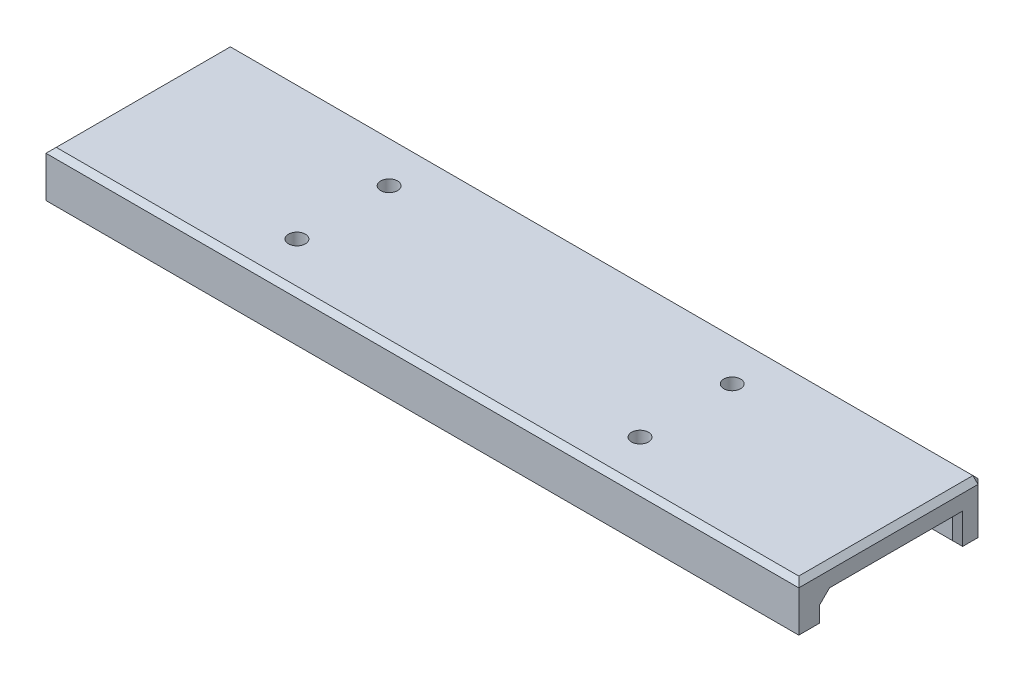
ISO-10303-21;
HEADER;
FILE_DESCRIPTION(('STEP AP214'),'2;1');
FILE_NAME('part.step','',(''),(''),'','','');
FILE_SCHEMA(('AUTOMOTIVE_DESIGN { 1 0 10303 214 1 1 1 1 }'));
ENDSEC;
DATA;
#1=APPLICATION_CONTEXT('core data for automotive mechanical design processes');
#2=APPLICATION_PROTOCOL_DEFINITION('international standard','automotive_design',2000,#1);
#3=PRODUCT_CONTEXT('',#1,'mechanical');
#4=PRODUCT('Part','Part','',(#3));
#5=PRODUCT_RELATED_PRODUCT_CATEGORY('part','',(#4));
#6=PRODUCT_DEFINITION_FORMATION('','',#4);
#7=PRODUCT_DEFINITION_CONTEXT('part definition',#1,'design');
#8=PRODUCT_DEFINITION('design','',#6,#7);
#9=PRODUCT_DEFINITION_SHAPE('','',#8);
#10=(LENGTH_UNIT() NAMED_UNIT(*) SI_UNIT(.MILLI.,.METRE.));
#11=(NAMED_UNIT(*) PLANE_ANGLE_UNIT() SI_UNIT($,.RADIAN.));
#12=(NAMED_UNIT(*) SI_UNIT($,.STERADIAN.) SOLID_ANGLE_UNIT());
#13=UNCERTAINTY_MEASURE_WITH_UNIT(LENGTH_MEASURE(1.E-05),#10,'distance_accuracy_value','');
#14=(GEOMETRIC_REPRESENTATION_CONTEXT(3) GLOBAL_UNCERTAINTY_ASSIGNED_CONTEXT((#13)) GLOBAL_UNIT_ASSIGNED_CONTEXT((#10,
#11,#12)) REPRESENTATION_CONTEXT('',''));
#15=CARTESIAN_POINT('',(0.,0.,0.));
#16=DIRECTION('',(0.,0.,1.));
#17=DIRECTION('',(1.,0.,0.));
#18=AXIS2_PLACEMENT_3D('',#15,#16,#17);
#19=CARTESIAN_POINT('',(-73.5,5.,18.));
#20=DIRECTION('',(1.,0.,0.));
#21=DIRECTION('',(0.,0.,-1.));
#22=AXIS2_PLACEMENT_3D('',#19,#20,#21);
#23=PLANE('',#22);
#24=DIRECTION('',(0.,0.,1.));
#25=VECTOR('',#24,1.);
#26=CARTESIAN_POINT('',(-73.5,-5.,18.));
#27=LINE('',#26,#25);
#28=CARTESIAN_POINT('',(-73.5,-5.,-17.));
#29=VERTEX_POINT('',#28);
#30=CARTESIAN_POINT('',(-73.5,-5.,-14.));
#31=VERTEX_POINT('',#30);
#32=EDGE_CURVE('E368',#29,#31,#27,.T.);
#33=ORIENTED_EDGE('',*,*,#32,.T.);
#34=DIRECTION('',(0.,1.,0.));
#35=VECTOR('',#34,1.);
#36=CARTESIAN_POINT('',(-73.5,5.,-14.));
#37=LINE('',#36,#35);
#38=CARTESIAN_POINT('',(-73.5,1.,-14.));
#39=VERTEX_POINT('',#38);
#40=EDGE_CURVE('E249',#31,#39,#37,.T.);
#41=ORIENTED_EDGE('',*,*,#40,.T.);
#42=DIRECTION('',(0.,0.,1.));
#43=VECTOR('',#42,1.);
#44=CARTESIAN_POINT('',(-73.5,1.,18.));
#45=LINE('',#44,#43);
#46=CARTESIAN_POINT('',(-73.5,1.,12.));
#47=VERTEX_POINT('',#46);
#48=EDGE_CURVE('E247',#39,#47,#45,.T.);
#49=ORIENTED_EDGE('',*,*,#48,.T.);
#50=DIRECTION('',(0.,0.707106781186543,-0.707106781186552));
#51=VECTOR('',#50,1.);
#52=CARTESIAN_POINT('',(-73.5,1.,12.));
#53=LINE('',#52,#51);
#54=CARTESIAN_POINT('',(-73.5,0.,13.));
#55=VERTEX_POINT('',#54);
#56=EDGE_CURVE('E244',#55,#47,#53,.T.);
#57=ORIENTED_EDGE('',*,*,#56,.F.);
#58=DIRECTION('',(0.,0.707106781186543,-0.707106781186552));
#59=VECTOR('',#58,1.);
#60=CARTESIAN_POINT('',(-73.5,1.,12.));
#61=LINE('',#60,#59);
#62=CARTESIAN_POINT('',(-73.5,-0.999999999999987,14.));
#63=VERTEX_POINT('',#62);
#64=EDGE_CURVE('E241',#63,#55,#61,.T.);
#65=ORIENTED_EDGE('',*,*,#64,.F.);
#66=DIRECTION('',(0.,-1.,0.));
#67=VECTOR('',#66,1.);
#68=CARTESIAN_POINT('',(-73.5,5.,14.));
#69=LINE('',#68,#67);
#70=CARTESIAN_POINT('',(-73.5,-4.00000000000001,14.));
#71=VERTEX_POINT('',#70);
#72=EDGE_CURVE('E239',#63,#71,#69,.T.);
#73=ORIENTED_EDGE('',*,*,#72,.T.);
#74=DIRECTION('',(0.,0.,1.));
#75=VECTOR('',#74,1.);
#76=CARTESIAN_POINT('',(-73.5,-4.00000000000001,18.));
#77=LINE('',#76,#75);
#78=CARTESIAN_POINT('',(-73.5,-4.00000000000001,18.));
#79=VERTEX_POINT('',#78);
#80=EDGE_CURVE('E237',#71,#79,#77,.T.);
#81=ORIENTED_EDGE('',*,*,#80,.T.);
#82=DIRECTION('',(0.,-1.,0.));
#83=VECTOR('',#82,1.);
#84=CARTESIAN_POINT('',(-73.5,5.,18.));
#85=LINE('',#84,#83);
#86=CARTESIAN_POINT('',(-73.5,3.99999999999999,18.));
#87=VERTEX_POINT('',#86);
#88=EDGE_CURVE('E374',#87,#79,#85,.T.);
#89=ORIENTED_EDGE('',*,*,#88,.F.);
#90=DIRECTION('',(0.,0.,-1.));
#91=VECTOR('',#90,1.);
#92=CARTESIAN_POINT('',(-73.5,3.99999999999999,18.));
#93=LINE('',#92,#91);
#94=CARTESIAN_POINT('',(-73.5,3.99999999999999,-17.));
#95=VERTEX_POINT('',#94);
#96=EDGE_CURVE('E235',#87,#95,#93,.T.);
#97=ORIENTED_EDGE('',*,*,#96,.T.);
#98=DIRECTION('',(0.,-1.,0.));
#99=VECTOR('',#98,1.);
#100=CARTESIAN_POINT('',(-73.5,5.,-17.));
#101=LINE('',#100,#99);
#102=EDGE_CURVE('E233',#95,#29,#101,.T.);
#103=ORIENTED_EDGE('',*,*,#102,.T.);
#104=EDGE_LOOP('',(#33,#41,#49,#57,#65,#73,#81,#89,#97,#103));
#105=FACE_BOUND('',#104,.T.);
#106=ADVANCED_FACE('F35',(#105),#23,.F.);
#107=CARTESIAN_POINT('',(73.5,5.,18.));
#108=DIRECTION('',(-1.,0.,0.));
#109=DIRECTION('',(0.,0.,1.));
#110=AXIS2_PLACEMENT_3D('',#107,#108,#109);
#111=PLANE('',#110);
#112=DIRECTION('',(0.,0.,-1.));
#113=VECTOR('',#112,1.);
#114=CARTESIAN_POINT('',(73.5,0.999999999999987,18.));
#115=LINE('',#114,#113);
#116=CARTESIAN_POINT('',(73.5,0.999999999999987,12.));
#117=VERTEX_POINT('',#116);
#118=CARTESIAN_POINT('',(73.5,0.999999999999987,-14.));
#119=VERTEX_POINT('',#118);
#120=EDGE_CURVE('E195',#117,#119,#115,.T.);
#121=ORIENTED_EDGE('',*,*,#120,.T.);
#122=DIRECTION('',(0.,-1.,0.));
#123=VECTOR('',#122,1.);
#124=CARTESIAN_POINT('',(73.5,5.,-14.));
#125=LINE('',#124,#123);
#126=CARTESIAN_POINT('',(73.5,-5.,-14.));
#127=VERTEX_POINT('',#126);
#128=EDGE_CURVE('E197',#119,#127,#125,.T.);
#129=ORIENTED_EDGE('',*,*,#128,.T.);
#130=DIRECTION('',(0.,0.,-1.));
#131=VECTOR('',#130,1.);
#132=CARTESIAN_POINT('',(73.5,-5.,18.));
#133=LINE('',#132,#131);
#134=CARTESIAN_POINT('',(73.5,-5.,-17.));
#135=VERTEX_POINT('',#134);
#136=EDGE_CURVE('E365',#127,#135,#133,.T.);
#137=ORIENTED_EDGE('',*,*,#136,.T.);
#138=DIRECTION('',(0.,1.,0.));
#139=VECTOR('',#138,1.);
#140=CARTESIAN_POINT('',(73.5,5.,-17.));
#141=LINE('',#140,#139);
#142=CARTESIAN_POINT('',(73.5,3.99999999999999,-17.));
#143=VERTEX_POINT('',#142);
#144=EDGE_CURVE('E386',#135,#143,#141,.T.);
#145=ORIENTED_EDGE('',*,*,#144,.T.);
#146=DIRECTION('',(0.,0.,1.));
#147=VECTOR('',#146,1.);
#148=CARTESIAN_POINT('',(73.5,3.99999999999999,18.));
#149=LINE('',#148,#147);
#150=CARTESIAN_POINT('',(73.5,3.99999999999999,18.));
#151=VERTEX_POINT('',#150);
#152=EDGE_CURVE('E388',#143,#151,#149,.T.);
#153=ORIENTED_EDGE('',*,*,#152,.T.);
#154=DIRECTION('',(0.,-1.,0.));
#155=VECTOR('',#154,1.);
#156=CARTESIAN_POINT('',(73.5,5.,18.));
#157=LINE('',#156,#155);
#158=CARTESIAN_POINT('',(73.5,-4.00000000000001,18.));
#159=VERTEX_POINT('',#158);
#160=EDGE_CURVE('E371',#151,#159,#157,.T.);
#161=ORIENTED_EDGE('',*,*,#160,.T.);
#162=DIRECTION('',(0.,0.,-1.));
#163=VECTOR('',#162,1.);
#164=CARTESIAN_POINT('',(73.5,-4.00000000000001,13.));
#165=LINE('',#164,#163);
#166=CARTESIAN_POINT('',(73.5,-4.00000000000001,14.));
#167=VERTEX_POINT('',#166);
#168=EDGE_CURVE('E390',#159,#167,#165,.T.);
#169=ORIENTED_EDGE('',*,*,#168,.T.);
#170=DIRECTION('',(0.,1.,0.));
#171=VECTOR('',#170,1.);
#172=CARTESIAN_POINT('',(73.5,5.,14.));
#173=LINE('',#172,#171);
#174=CARTESIAN_POINT('',(73.5,-0.999999999999987,14.));
#175=VERTEX_POINT('',#174);
#176=EDGE_CURVE('E187',#167,#175,#173,.T.);
#177=ORIENTED_EDGE('',*,*,#176,.T.);
#178=DIRECTION('',(0.,-0.707106781186543,0.707106781186552));
#179=VECTOR('',#178,1.);
#180=CARTESIAN_POINT('',(73.5,-0.999999999999987,14.));
#181=LINE('',#180,#179);
#182=CARTESIAN_POINT('',(73.5,0.,13.));
#183=VERTEX_POINT('',#182);
#184=EDGE_CURVE('E181',#183,#175,#181,.T.);
#185=ORIENTED_EDGE('',*,*,#184,.F.);
#186=DIRECTION('',(0.,-0.707106781186543,0.707106781186552));
#187=VECTOR('',#186,1.);
#188=CARTESIAN_POINT('',(73.5,-0.999999999999987,14.));
#189=LINE('',#188,#187);
#190=EDGE_CURVE('E184',#117,#183,#189,.T.);
#191=ORIENTED_EDGE('',*,*,#190,.F.);
#192=EDGE_LOOP('',(#121,#129,#137,#145,#153,#161,#169,#177,#185,#191));
#193=FACE_BOUND('',#192,.T.);
#194=ADVANCED_FACE('F183',(#193),#111,.F.);
#195=CARTESIAN_POINT('',(0.,-5.,0.));
#196=DIRECTION('',(0.,-1.,0.));
#197=DIRECTION('',(0.,0.,-1.));
#198=AXIS2_PLACEMENT_3D('',#195,#196,#197);
#199=PLANE('',#198);
#200=DIRECTION('',(0.,0.,1.));
#201=VECTOR('',#200,1.);
#202=CARTESIAN_POINT('',(72.5,-5.,18.));
#203=LINE('',#202,#201);
#204=CARTESIAN_POINT('',(72.5,-5.,14.));
#205=VERTEX_POINT('',#204);
#206=CARTESIAN_POINT('',(72.5,-5.,17.));
#207=VERTEX_POINT('',#206);
#208=EDGE_CURVE('E209',#205,#207,#203,.T.);
#209=ORIENTED_EDGE('',*,*,#208,.T.);
#210=DIRECTION('',(-1.,0.,0.));
#211=VECTOR('',#210,1.);
#212=CARTESIAN_POINT('',(-73.5,-5.,17.));
#213=LINE('',#212,#211);
#214=CARTESIAN_POINT('',(-72.5,-5.,17.));
#215=VERTEX_POINT('',#214);
#216=EDGE_CURVE('E213',#207,#215,#213,.T.);
#217=ORIENTED_EDGE('',*,*,#216,.T.);
#218=DIRECTION('',(0.,0.,-1.));
#219=VECTOR('',#218,1.);
#220=CARTESIAN_POINT('',(-72.5,-5.,13.));
#221=LINE('',#220,#219);
#222=CARTESIAN_POINT('',(-72.5,-5.,14.));
#223=VERTEX_POINT('',#222);
#224=EDGE_CURVE('E211',#215,#223,#221,.T.);
#225=ORIENTED_EDGE('',*,*,#224,.T.);
#226=DIRECTION('',(1.,0.,0.));
#227=VECTOR('',#226,1.);
#228=CARTESIAN_POINT('',(73.5,-5.,14.));
#229=LINE('',#228,#227);
#230=EDGE_CURVE('E207',#223,#205,#229,.T.);
#231=ORIENTED_EDGE('',*,*,#230,.T.);
#232=EDGE_LOOP('',(#209,#217,#225,#231));
#233=FACE_BOUND('',#232,.T.);
#234=ADVANCED_FACE('F523',(#233),#199,.T.);
#235=CARTESIAN_POINT('',(-73.5,5.,-18.));
#236=DIRECTION('',(0.,0.,1.));
#237=DIRECTION('',(1.,0.,0.));
#238=AXIS2_PLACEMENT_3D('',#235,#236,#237);
#239=PLANE('',#238);
#240=DIRECTION('',(0.,1.,0.));
#241=VECTOR('',#240,1.);
#242=CARTESIAN_POINT('',(-72.5,5.,-18.));
#243=LINE('',#242,#241);
#244=CARTESIAN_POINT('',(-72.5,-3.99999999999999,-18.));
#245=VERTEX_POINT('',#244);
#246=CARTESIAN_POINT('',(-72.5,3.99999999999999,-18.));
#247=VERTEX_POINT('',#246);
#248=EDGE_CURVE('E260',#245,#247,#243,.T.);
#249=ORIENTED_EDGE('',*,*,#248,.T.);
#250=DIRECTION('',(1.,0.,0.));
#251=VECTOR('',#250,1.);
#252=CARTESIAN_POINT('',(-73.5,3.99999999999999,-18.));
#253=LINE('',#252,#251);
#254=CARTESIAN_POINT('',(72.5,3.99999999999999,-18.));
#255=VERTEX_POINT('',#254);
#256=EDGE_CURVE('E11',#247,#255,#253,.T.);
#257=ORIENTED_EDGE('',*,*,#256,.T.);
#258=DIRECTION('',(0.,-1.,0.));
#259=VECTOR('',#258,1.);
#260=CARTESIAN_POINT('',(72.5,5.,-18.));
#261=LINE('',#260,#259);
#262=CARTESIAN_POINT('',(72.5,-3.99999999999999,-18.));
#263=VERTEX_POINT('',#262);
#264=EDGE_CURVE('E44',#255,#263,#261,.T.);
#265=ORIENTED_EDGE('',*,*,#264,.T.);
#266=DIRECTION('',(-1.,0.,0.));
#267=VECTOR('',#266,1.);
#268=CARTESIAN_POINT('',(-73.5,-3.99999999999999,-18.));
#269=LINE('',#268,#267);
#270=EDGE_CURVE('E262',#263,#245,#269,.T.);
#271=ORIENTED_EDGE('',*,*,#270,.T.);
#272=EDGE_LOOP('',(#249,#257,#265,#271));
#273=FACE_BOUND('',#272,.T.);
#274=ADVANCED_FACE('F493',(#273),#239,.F.);
#275=CARTESIAN_POINT('',(-73.5,5.,18.));
#276=DIRECTION('',(0.,0.,-1.));
#277=DIRECTION('',(-1.,0.,0.));
#278=AXIS2_PLACEMENT_3D('',#275,#276,#277);
#279=PLANE('',#278);
#280=ORIENTED_EDGE('',*,*,#88,.T.);
#281=DIRECTION('',(1.,0.,0.));
#282=VECTOR('',#281,1.);
#283=CARTESIAN_POINT('',(73.5,-4.00000000000001,18.));
#284=LINE('',#283,#282);
#285=EDGE_CURVE('E205',#79,#159,#284,.T.);
#286=ORIENTED_EDGE('',*,*,#285,.T.);
#287=ORIENTED_EDGE('',*,*,#160,.F.);
#288=DIRECTION('',(-1.,0.,0.));
#289=VECTOR('',#288,1.);
#290=CARTESIAN_POINT('',(-73.5,3.99999999999999,18.));
#291=LINE('',#290,#289);
#292=EDGE_CURVE('E202',#151,#87,#291,.T.);
#293=ORIENTED_EDGE('',*,*,#292,.T.);
#294=EDGE_LOOP('',(#280,#286,#287,#293));
#295=FACE_BOUND('',#294,.T.);
#296=ADVANCED_FACE('F469',(#295),#279,.F.);
#297=CARTESIAN_POINT('',(0.,5.,0.));
#298=DIRECTION('',(0.,-1.,0.));
#299=DIRECTION('',(0.,0.,-1.));
#300=AXIS2_PLACEMENT_3D('',#297,#298,#299);
#301=PLANE('',#300);
#302=CARTESIAN_POINT('',(-33.5,4.99999999999999,8.99999999999992));
#303=DIRECTION('',(0.,1.,0.));
#304=DIRECTION('',(0.,0.,1.));
#305=AXIS2_PLACEMENT_3D('',#302,#303,#304);
#306=CIRCLE('',#305,1.64999999999999);
#307=CARTESIAN_POINT('',(-33.5,4.99999999999999,10.6499999999999));
#308=VERTEX_POINT('',#307);
#309=EDGE_CURVE('E356',#308,#308,#306,.T.);
#310=ORIENTED_EDGE('',*,*,#309,.F.);
#311=EDGE_LOOP('',(#310));
#312=FACE_BOUND('',#311,.T.);
#313=CARTESIAN_POINT('',(33.5,4.99999999999999,8.99999999999992));
#314=DIRECTION('',(0.,1.,0.));
#315=DIRECTION('',(0.,0.,1.));
#316=AXIS2_PLACEMENT_3D('',#313,#314,#315);
#317=CIRCLE('',#316,1.64999999999999);
#318=CARTESIAN_POINT('',(33.5,4.99999999999999,10.6499999999999));
#319=VERTEX_POINT('',#318);
#320=EDGE_CURVE('E346',#319,#319,#317,.T.);
#321=ORIENTED_EDGE('',*,*,#320,.F.);
#322=EDGE_LOOP('',(#321));
#323=FACE_BOUND('',#322,.T.);
#324=CARTESIAN_POINT('',(-33.5000000000001,4.99999999999999,-9.00000000000007));
#325=DIRECTION('',(0.,1.,0.));
#326=DIRECTION('',(0.,0.,1.));
#327=AXIS2_PLACEMENT_3D('',#324,#325,#326);
#328=CIRCLE('',#327,1.64999999999999);
#329=CARTESIAN_POINT('',(-33.5000000000001,4.99999999999999,-7.35000000000008));
#330=VERTEX_POINT('',#329);
#331=EDGE_CURVE('E343',#330,#330,#328,.T.);
#332=ORIENTED_EDGE('',*,*,#331,.F.);
#333=EDGE_LOOP('',(#332));
#334=FACE_BOUND('',#333,.T.);
#335=CARTESIAN_POINT('',(33.5,4.99999999999999,-9.00000000000007));
#336=DIRECTION('',(0.,1.,0.));
#337=DIRECTION('',(0.,0.,1.));
#338=AXIS2_PLACEMENT_3D('',#335,#336,#337);
#339=CIRCLE('',#338,1.64999999999999);
#340=CARTESIAN_POINT('',(33.5,4.99999999999999,-7.35000000000008));
#341=VERTEX_POINT('',#340);
#342=EDGE_CURVE('E342',#341,#341,#339,.T.);
#343=ORIENTED_EDGE('',*,*,#342,.F.);
#344=EDGE_LOOP('',(#343));
#345=FACE_BOUND('',#344,.T.);
#346=DIRECTION('',(0.,0.,1.));
#347=VECTOR('',#346,1.);
#348=CARTESIAN_POINT('',(-72.5,5.,0.));
#349=LINE('',#348,#347);
#350=CARTESIAN_POINT('',(-72.5,5.,-17.));
#351=VERTEX_POINT('',#350);
#352=CARTESIAN_POINT('',(-72.5,5.,17.));
#353=VERTEX_POINT('',#352);
#354=EDGE_CURVE('E255',#351,#353,#349,.T.);
#355=ORIENTED_EDGE('',*,*,#354,.T.);
#356=DIRECTION('',(1.,0.,0.));
#357=VECTOR('',#356,1.);
#358=CARTESIAN_POINT('',(0.,5.,17.));
#359=LINE('',#358,#357);
#360=CARTESIAN_POINT('',(72.5,5.,17.));
#361=VERTEX_POINT('',#360);
#362=EDGE_CURVE('E257',#353,#361,#359,.T.);
#363=ORIENTED_EDGE('',*,*,#362,.T.);
#364=DIRECTION('',(0.,0.,-1.));
#365=VECTOR('',#364,1.);
#366=CARTESIAN_POINT('',(72.5,5.,0.));
#367=LINE('',#366,#365);
#368=CARTESIAN_POINT('',(72.5,5.,-17.));
#369=VERTEX_POINT('',#368);
#370=EDGE_CURVE('E253',#361,#369,#367,.T.);
#371=ORIENTED_EDGE('',*,*,#370,.T.);
#372=DIRECTION('',(-1.,0.,0.));
#373=VECTOR('',#372,1.);
#374=CARTESIAN_POINT('',(0.,5.,-17.));
#375=LINE('',#374,#373);
#376=EDGE_CURVE('E251',#369,#351,#375,.T.);
#377=ORIENTED_EDGE('',*,*,#376,.T.);
#378=EDGE_LOOP('',(#355,#363,#371,#377));
#379=FACE_BOUND('',#378,.T.);
#380=ADVANCED_FACE('F487',(#312,#323,#334,#345,#379),#301,.F.);
#381=ORIENTED_EDGE('',*,*,#136,.F.);
#382=DIRECTION('',(-1.,0.,0.));
#383=VECTOR('',#382,1.);
#384=CARTESIAN_POINT('',(-73.5,-5.,-14.));
#385=LINE('',#384,#383);
#386=EDGE_CURVE('E231',#127,#31,#385,.T.);
#387=ORIENTED_EDGE('',*,*,#386,.T.);
#388=ORIENTED_EDGE('',*,*,#32,.F.);
#389=DIRECTION('',(1.,0.,0.));
#390=VECTOR('',#389,1.);
#391=CARTESIAN_POINT('',(73.5,-5.,-17.));
#392=LINE('',#391,#390);
#393=EDGE_CURVE('E229',#29,#135,#392,.T.);
#394=ORIENTED_EDGE('',*,*,#393,.T.);
#395=EDGE_LOOP('',(#381,#387,#388,#394));
#396=FACE_BOUND('',#395,.T.);
#397=ADVANCED_FACE('F436',(#396),#199,.T.);
#398=CARTESIAN_POINT('',(-73.5,-5.,13.));
#399=DIRECTION('',(0.,0.,1.));
#400=DIRECTION('',(1.,0.,0.));
#401=AXIS2_PLACEMENT_3D('',#398,#399,#400);
#402=PLANE('',#401);
#403=DIRECTION('',(1.,0.,0.));
#404=VECTOR('',#403,1.);
#405=CARTESIAN_POINT('',(73.5,-0.999999999999987,13.));
#406=LINE('',#405,#404);
#407=CARTESIAN_POINT('',(-72.5,-0.999999999999987,13.));
#408=VERTEX_POINT('',#407);
#409=CARTESIAN_POINT('',(72.5,-0.999999999999987,13.));
#410=VERTEX_POINT('',#409);
#411=EDGE_CURVE('E381',#408,#410,#406,.T.);
#412=ORIENTED_EDGE('',*,*,#411,.T.);
#413=DIRECTION('',(0.,-1.,0.));
#414=VECTOR('',#413,1.);
#415=CARTESIAN_POINT('',(72.5,-5.,13.));
#416=LINE('',#415,#414);
#417=CARTESIAN_POINT('',(72.5,-4.00000000000001,13.));
#418=VERTEX_POINT('',#417);
#419=EDGE_CURVE('E383',#410,#418,#416,.T.);
#420=ORIENTED_EDGE('',*,*,#419,.T.);
#421=DIRECTION('',(-1.,0.,0.));
#422=VECTOR('',#421,1.);
#423=CARTESIAN_POINT('',(-73.5,-4.00000000000001,13.));
#424=LINE('',#423,#422);
#425=CARTESIAN_POINT('',(-72.5,-4.00000000000001,13.));
#426=VERTEX_POINT('',#425);
#427=EDGE_CURVE('E377',#418,#426,#424,.T.);
#428=ORIENTED_EDGE('',*,*,#427,.T.);
#429=DIRECTION('',(0.,1.,0.));
#430=VECTOR('',#429,1.);
#431=CARTESIAN_POINT('',(-72.5,-5.,13.));
#432=LINE('',#431,#430);
#433=EDGE_CURVE('E379',#426,#408,#432,.T.);
#434=ORIENTED_EDGE('',*,*,#433,.T.);
#435=EDGE_LOOP('',(#412,#420,#428,#434));
#436=FACE_BOUND('',#435,.T.);
#437=ADVANCED_FACE('F412',(#436),#402,.F.);
#438=CARTESIAN_POINT('',(-73.5,0.,13.));
#439=DIRECTION('',(0.,1.,0.));
#440=DIRECTION('',(0.,0.,1.));
#441=AXIS2_PLACEMENT_3D('',#438,#439,#440);
#442=PLANE('',#441);
#443=CARTESIAN_POINT('',(-33.5,0.,8.99999999999992));
#444=DIRECTION('',(0.,1.,0.));
#445=DIRECTION('',(0.,0.,1.));
#446=AXIS2_PLACEMENT_3D('',#443,#444,#445);
#447=CIRCLE('',#446,1.64999999999999);
#448=CARTESIAN_POINT('',(-33.5,0.,10.6499999999999));
#449=VERTEX_POINT('',#448);
#450=EDGE_CURVE('E39',#449,#449,#447,.T.);
#451=ORIENTED_EDGE('',*,*,#450,.T.);
#452=EDGE_LOOP('',(#451));
#453=FACE_BOUND('',#452,.T.);
#454=CARTESIAN_POINT('',(33.5,0.,8.99999999999992));
#455=DIRECTION('',(0.,1.,0.));
#456=DIRECTION('',(0.,0.,1.));
#457=AXIS2_PLACEMENT_3D('',#454,#455,#456);
#458=CIRCLE('',#457,1.64999999999999);
#459=CARTESIAN_POINT('',(33.5,0.,10.6499999999999));
#460=VERTEX_POINT('',#459);
#461=EDGE_CURVE('E344',#460,#460,#458,.T.);
#462=ORIENTED_EDGE('',*,*,#461,.T.);
#463=EDGE_LOOP('',(#462));
#464=FACE_BOUND('',#463,.T.);
#465=CARTESIAN_POINT('',(-33.5000000000001,0.,-9.00000000000007));
#466=DIRECTION('',(0.,1.,0.));
#467=DIRECTION('',(0.,0.,1.));
#468=AXIS2_PLACEMENT_3D('',#465,#466,#467);
#469=CIRCLE('',#468,1.64999999999999);
#470=CARTESIAN_POINT('',(-33.5000000000001,0.,-7.35000000000009));
#471=VERTEX_POINT('',#470);
#472=EDGE_CURVE('E340',#471,#471,#469,.T.);
#473=ORIENTED_EDGE('',*,*,#472,.T.);
#474=EDGE_LOOP('',(#473));
#475=FACE_BOUND('',#474,.T.);
#476=CARTESIAN_POINT('',(33.5,0.,-9.00000000000007));
#477=DIRECTION('',(0.,1.,0.));
#478=DIRECTION('',(0.,0.,1.));
#479=AXIS2_PLACEMENT_3D('',#476,#477,#478);
#480=CIRCLE('',#479,1.64999999999999);
#481=CARTESIAN_POINT('',(33.5,0.,-7.35000000000009));
#482=VERTEX_POINT('',#481);
#483=EDGE_CURVE('E318',#482,#482,#480,.T.);
#484=ORIENTED_EDGE('',*,*,#483,.T.);
#485=EDGE_LOOP('',(#484));
#486=FACE_BOUND('',#485,.T.);
#487=DIRECTION('',(1.,0.,0.));
#488=VECTOR('',#487,1.);
#489=CARTESIAN_POINT('',(-73.5,0.,-13.));
#490=LINE('',#489,#488);
#491=CARTESIAN_POINT('',(-72.5,0.,-13.));
#492=VERTEX_POINT('',#491);
#493=CARTESIAN_POINT('',(72.5,0.,-13.));
#494=VERTEX_POINT('',#493);
#495=EDGE_CURVE('E314',#492,#494,#490,.T.);
#496=ORIENTED_EDGE('',*,*,#495,.T.);
#497=DIRECTION('',(0.,0.,1.));
#498=VECTOR('',#497,1.);
#499=CARTESIAN_POINT('',(72.5,0.,13.));
#500=LINE('',#499,#498);
#501=CARTESIAN_POINT('',(72.5,0.,12.));
#502=VERTEX_POINT('',#501);
#503=EDGE_CURVE('E220',#494,#502,#500,.T.);
#504=ORIENTED_EDGE('',*,*,#503,.T.);
#505=DIRECTION('',(-1.,0.,0.));
#506=VECTOR('',#505,1.);
#507=CARTESIAN_POINT('',(-73.5,0.,12.));
#508=LINE('',#507,#506);
#509=CARTESIAN_POINT('',(-72.5,0.,12.));
#510=VERTEX_POINT('',#509);
#511=EDGE_CURVE('E216',#502,#510,#508,.T.);
#512=ORIENTED_EDGE('',*,*,#511,.T.);
#513=DIRECTION('',(0.,0.,-1.));
#514=VECTOR('',#513,1.);
#515=CARTESIAN_POINT('',(-72.5,0.,13.));
#516=LINE('',#515,#514);
#517=EDGE_CURVE('E218',#510,#492,#516,.T.);
#518=ORIENTED_EDGE('',*,*,#517,.T.);
#519=EDGE_LOOP('',(#496,#504,#512,#518));
#520=FACE_BOUND('',#519,.T.);
#521=ADVANCED_FACE('F566',(#453,#464,#475,#486,#520),#442,.F.);
#522=CARTESIAN_POINT('',(-73.5,0.,-13.));
#523=DIRECTION('',(0.,0.,-1.));
#524=DIRECTION('',(-1.,0.,0.));
#525=AXIS2_PLACEMENT_3D('',#522,#523,#524);
#526=PLANE('',#525);
#527=DIRECTION('',(1.,0.,0.));
#528=VECTOR('',#527,1.);
#529=CARTESIAN_POINT('',(73.5,-4.,-13.));
#530=LINE('',#529,#528);
#531=CARTESIAN_POINT('',(-72.5,-4.,-13.));
#532=VERTEX_POINT('',#531);
#533=CARTESIAN_POINT('',(72.5,-4.,-13.));
#534=VERTEX_POINT('',#533);
#535=EDGE_CURVE('E225',#532,#534,#530,.T.);
#536=ORIENTED_EDGE('',*,*,#535,.T.);
#537=DIRECTION('',(0.,1.,0.));
#538=VECTOR('',#537,1.);
#539=CARTESIAN_POINT('',(72.5,0.,-13.));
#540=LINE('',#539,#538);
#541=EDGE_CURVE('E227',#534,#494,#540,.T.);
#542=ORIENTED_EDGE('',*,*,#541,.T.);
#543=ORIENTED_EDGE('',*,*,#495,.F.);
#544=DIRECTION('',(0.,-1.,0.));
#545=VECTOR('',#544,1.);
#546=CARTESIAN_POINT('',(-72.5,0.,-13.));
#547=LINE('',#546,#545);
#548=EDGE_CURVE('E223',#492,#532,#547,.T.);
#549=ORIENTED_EDGE('',*,*,#548,.T.);
#550=EDGE_LOOP('',(#536,#542,#543,#549));
#551=FACE_BOUND('',#550,.T.);
#552=ADVANCED_FACE('F562',(#551),#526,.F.);
#553=CARTESIAN_POINT('',(-73.5,5.,-14.));
#554=DIRECTION('',(0.707106781186554,0.,-0.707106781186541));
#555=DIRECTION('',(0.,1.,0.));
#556=AXIS2_PLACEMENT_3D('',#553,#554,#555);
#557=PLANE('',#556);
#558=DIRECTION('',(0.57735026918962,-0.577350269189628,0.57735026918963));
#559=VECTOR('',#558,1.);
#560=CARTESIAN_POINT('',(-74.8333333333333,2.33333333333334,-15.3333333333333));
#561=LINE('',#560,#559);
#562=EDGE_CURVE('E308',#39,#492,#561,.T.);
#563=ORIENTED_EDGE('',*,*,#562,.F.);
#564=ORIENTED_EDGE('',*,*,#40,.F.);
#565=DIRECTION('',(-0.577350269189616,-0.577350269189634,-0.577350269189626));
#566=VECTOR('',#565,1.);
#567=CARTESIAN_POINT('',(-70.1666666666667,-1.66666666666658,-10.6666666666666));
#568=LINE('',#567,#566);
#569=EDGE_CURVE('E311',#532,#31,#568,.T.);
#570=ORIENTED_EDGE('',*,*,#569,.F.);
#571=ORIENTED_EDGE('',*,*,#548,.F.);
#572=EDGE_LOOP('',(#563,#564,#570,#571));
#573=FACE_BOUND('',#572,.T.);
#574=ADVANCED_FACE('F443',(#573),#557,.F.);
#575=CARTESIAN_POINT('',(-73.5,-4.,-13.));
#576=DIRECTION('',(0.,-0.707106781186543,0.707106781186552));
#577=DIRECTION('',(-1.,0.,0.));
#578=AXIS2_PLACEMENT_3D('',#575,#576,#577);
#579=PLANE('',#578);
#580=ORIENTED_EDGE('',*,*,#569,.T.);
#581=ORIENTED_EDGE('',*,*,#386,.F.);
#582=DIRECTION('',(0.577350269189627,-0.577350269189629,-0.577350269189621));
#583=VECTOR('',#582,1.);
#584=CARTESIAN_POINT('',(23.8333333333331,44.6666666666671,35.6666666666664));
#585=LINE('',#584,#583);
#586=EDGE_CURVE('E305',#534,#127,#585,.T.);
#587=ORIENTED_EDGE('',*,*,#586,.F.);
#588=ORIENTED_EDGE('',*,*,#535,.F.);
#589=EDGE_LOOP('',(#580,#581,#587,#588));
#590=FACE_BOUND('',#589,.T.);
#591=ADVANCED_FACE('F432',(#590),#579,.T.);
#592=CARTESIAN_POINT('',(-73.5,1.,18.));
#593=DIRECTION('',(0.707106781186552,0.707106781186543,0.));
#594=DIRECTION('',(0.,0.,1.));
#595=AXIS2_PLACEMENT_3D('',#592,#593,#594);
#596=PLANE('',#595);
#597=ORIENTED_EDGE('',*,*,#562,.T.);
#598=ORIENTED_EDGE('',*,*,#517,.F.);
#599=DIRECTION('',(0.707106781186543,-0.707106781186552,0.));
#600=VECTOR('',#599,1.);
#601=CARTESIAN_POINT('',(-73.5,1.,12.));
#602=LINE('',#601,#600);
#603=EDGE_CURVE('E302',#47,#510,#602,.T.);
#604=ORIENTED_EDGE('',*,*,#603,.F.);
#605=ORIENTED_EDGE('',*,*,#48,.F.);
#606=EDGE_LOOP('',(#597,#598,#604,#605));
#607=FACE_BOUND('',#606,.T.);
#608=ADVANCED_FACE('F449',(#607),#596,.F.);
#609=CARTESIAN_POINT('',(-73.5,5.,14.));
#610=DIRECTION('',(0.707106781186552,0.,0.707106781186543));
#611=DIRECTION('',(0.,-1.,0.));
#612=AXIS2_PLACEMENT_3D('',#609,#610,#611);
#613=PLANE('',#612);
#614=DIRECTION('',(-0.707106781186543,0.,0.707106781186552));
#615=VECTOR('',#614,1.);
#616=CARTESIAN_POINT('',(-73.5,-4.00000000000001,14.));
#617=LINE('',#616,#615);
#618=EDGE_CURVE('E296',#71,#426,#617,.F.);
#619=ORIENTED_EDGE('',*,*,#618,.F.);
#620=ORIENTED_EDGE('',*,*,#72,.F.);
#621=DIRECTION('',(-0.707106781186543,0.,0.707106781186552));
#622=VECTOR('',#621,1.);
#623=CARTESIAN_POINT('',(-72.5,-0.999999999999987,13.));
#624=LINE('',#623,#622);
#625=EDGE_CURVE('E299',#408,#63,#624,.T.);
#626=ORIENTED_EDGE('',*,*,#625,.F.);
#627=ORIENTED_EDGE('',*,*,#433,.F.);
#628=EDGE_LOOP('',(#619,#620,#626,#627));
#629=FACE_BOUND('',#628,.T.);
#630=ADVANCED_FACE('F456',(#629),#613,.F.);
#631=CARTESIAN_POINT('',(-73.5,-4.00000000000001,18.));
#632=DIRECTION('',(-0.707106781186543,-0.707106781186552,0.));
#633=DIRECTION('',(0.,0.,-1.));
#634=AXIS2_PLACEMENT_3D('',#631,#632,#633);
#635=PLANE('',#634);
#636=DIRECTION('',(-0.577350269189628,0.57735026918962,0.577350269189628));
#637=VECTOR('',#636,1.);
#638=CARTESIAN_POINT('',(-73.5,-4.00000000000001,18.));
#639=LINE('',#638,#637);
#640=EDGE_CURVE('E291',#79,#215,#639,.F.);
#641=ORIENTED_EDGE('',*,*,#640,.F.);
#642=ORIENTED_EDGE('',*,*,#80,.F.);
#643=DIRECTION('',(-0.707106781186552,0.707106781186543,0.));
#644=VECTOR('',#643,1.);
#645=CARTESIAN_POINT('',(-73.5,-4.00000000000001,14.));
#646=LINE('',#645,#644);
#647=EDGE_CURVE('E293',#223,#71,#646,.T.);
#648=ORIENTED_EDGE('',*,*,#647,.F.);
#649=ORIENTED_EDGE('',*,*,#224,.F.);
#650=EDGE_LOOP('',(#641,#642,#648,#649));
#651=FACE_BOUND('',#650,.T.);
#652=ADVANCED_FACE('F462',(#651),#635,.T.);
#653=CARTESIAN_POINT('',(72.5,0.,-13.));
#654=DIRECTION('',(-0.707106781186544,0.,-0.707106781186551));
#655=DIRECTION('',(0.,1.,0.));
#656=AXIS2_PLACEMENT_3D('',#653,#654,#655);
#657=PLANE('',#656);
#658=ORIENTED_EDGE('',*,*,#586,.T.);
#659=ORIENTED_EDGE('',*,*,#128,.F.);
#660=DIRECTION('',(-0.57735026918963,-0.577350269189622,0.577350269189624));
#661=VECTOR('',#660,1.);
#662=CARTESIAN_POINT('',(63.8333333333333,-8.6666666666666,-4.33333333333337));
#663=LINE('',#662,#661);
#664=EDGE_CURVE('E288',#494,#119,#663,.F.);
#665=ORIENTED_EDGE('',*,*,#664,.F.);
#666=ORIENTED_EDGE('',*,*,#541,.F.);
#667=EDGE_LOOP('',(#658,#659,#665,#666));
#668=FACE_BOUND('',#667,.T.);
#669=ADVANCED_FACE('F426',(#668),#657,.F.);
#670=CARTESIAN_POINT('',(-72.5,0.,12.));
#671=DIRECTION('',(-0.577350269189634,-0.577350269189626,-0.577350269189618));
#672=DIRECTION('',(0.707106781186543,-0.707106781186552,0.));
#673=AXIS2_PLACEMENT_3D('',#670,#671,#672);
#674=PLANE('',#673);
#675=ORIENTED_EDGE('',*,*,#56,.T.);
#676=ORIENTED_EDGE('',*,*,#603,.T.);
#677=DIRECTION('',(0.,0.707106781186543,-0.707106781186552));
#678=VECTOR('',#677,1.);
#679=CARTESIAN_POINT('',(-72.5,0.,12.));
#680=LINE('',#679,#678);
#681=EDGE_CURVE('E285',#408,#510,#680,.T.);
#682=ORIENTED_EDGE('',*,*,#681,.F.);
#683=ORIENTED_EDGE('',*,*,#625,.T.);
#684=ORIENTED_EDGE('',*,*,#64,.T.);
#685=EDGE_LOOP('',(#675,#676,#682,#683,#684));
#686=FACE_BOUND('',#685,.T.);
#687=ADVANCED_FACE('F452',(#686),#674,.T.);
#688=CARTESIAN_POINT('',(-73.5,-4.00000000000001,14.));
#689=DIRECTION('',(-0.577350269189626,-0.577350269189634,-0.577350269189618));
#690=DIRECTION('',(0.707106781186552,-0.707106781186543,0.));
#691=AXIS2_PLACEMENT_3D('',#688,#689,#690);
#692=PLANE('',#691);
#693=ORIENTED_EDGE('',*,*,#647,.T.);
#694=ORIENTED_EDGE('',*,*,#618,.T.);
#695=DIRECTION('',(0.,-0.707106781186543,0.707106781186552));
#696=VECTOR('',#695,1.);
#697=CARTESIAN_POINT('',(-72.5,-4.50000000000001,13.5));
#698=LINE('',#697,#696);
#699=EDGE_CURVE('E282',#223,#426,#698,.F.);
#700=ORIENTED_EDGE('',*,*,#699,.F.);
#701=EDGE_LOOP('',(#693,#694,#700));
#702=FACE_BOUND('',#701,.T.);
#703=ADVANCED_FACE('F546',(#702),#692,.T.);
#704=CARTESIAN_POINT('',(-73.5,-4.00000000000001,18.));
#705=DIRECTION('',(0.,-0.707106781186552,0.707106781186543));
#706=DIRECTION('',(-1.,0.,0.));
#707=AXIS2_PLACEMENT_3D('',#704,#705,#706);
#708=PLANE('',#707);
#709=ORIENTED_EDGE('',*,*,#640,.T.);
#710=ORIENTED_EDGE('',*,*,#216,.F.);
#711=DIRECTION('',(-0.577350269189628,-0.57735026918962,-0.577350269189628));
#712=VECTOR('',#711,1.);
#713=CARTESIAN_POINT('',(73.5,-4.00000000000001,18.));
#714=LINE('',#713,#712);
#715=EDGE_CURVE('E279',#159,#207,#714,.T.);
#716=ORIENTED_EDGE('',*,*,#715,.F.);
#717=ORIENTED_EDGE('',*,*,#285,.F.);
#718=EDGE_LOOP('',(#709,#710,#716,#717));
#719=FACE_BOUND('',#718,.T.);
#720=ADVANCED_FACE('F467',(#719),#708,.T.);
#721=CARTESIAN_POINT('',(72.5,0.,13.));
#722=DIRECTION('',(-0.707106781186543,0.707106781186552,0.));
#723=DIRECTION('',(0.,0.,1.));
#724=AXIS2_PLACEMENT_3D('',#721,#722,#723);
#725=PLANE('',#724);
#726=ORIENTED_EDGE('',*,*,#664,.T.);
#727=ORIENTED_EDGE('',*,*,#120,.F.);
#728=DIRECTION('',(0.707106781186552,0.707106781186543,0.));
#729=VECTOR('',#728,1.);
#730=CARTESIAN_POINT('',(72.5,0.,12.));
#731=LINE('',#730,#729);
#732=EDGE_CURVE('E194',#502,#117,#731,.T.);
#733=ORIENTED_EDGE('',*,*,#732,.F.);
#734=ORIENTED_EDGE('',*,*,#503,.F.);
#735=EDGE_LOOP('',(#726,#727,#733,#734));
#736=FACE_BOUND('',#735,.T.);
#737=ADVANCED_FACE('F421',(#736),#725,.F.);
#738=CARTESIAN_POINT('',(-73.5,-0.999999999999987,13.));
#739=DIRECTION('',(0.,-0.707106781186552,-0.707106781186543));
#740=DIRECTION('',(-1.,0.,0.));
#741=AXIS2_PLACEMENT_3D('',#738,#739,#740);
#742=PLANE('',#741);
#743=ORIENTED_EDGE('',*,*,#681,.T.);
#744=ORIENTED_EDGE('',*,*,#511,.F.);
#745=DIRECTION('',(0.,-0.707106781186543,0.707106781186552));
#746=VECTOR('',#745,1.);
#747=CARTESIAN_POINT('',(72.5,-0.999999999999987,13.));
#748=LINE('',#747,#746);
#749=EDGE_CURVE('E276',#410,#502,#748,.F.);
#750=ORIENTED_EDGE('',*,*,#749,.F.);
#751=ORIENTED_EDGE('',*,*,#411,.F.);
#752=EDGE_LOOP('',(#743,#744,#750,#751));
#753=FACE_BOUND('',#752,.T.);
#754=ADVANCED_FACE('F418',(#753),#742,.T.);
#755=CARTESIAN_POINT('',(0.,-5.,14.));
#756=DIRECTION('',(0.,-0.707106781186552,-0.707106781186543));
#757=DIRECTION('',(-1.,0.,0.));
#758=AXIS2_PLACEMENT_3D('',#755,#756,#757);
#759=PLANE('',#758);
#760=ORIENTED_EDGE('',*,*,#699,.T.);
#761=ORIENTED_EDGE('',*,*,#427,.F.);
#762=DIRECTION('',(0.,0.707106781186543,-0.707106781186552));
#763=VECTOR('',#762,1.);
#764=CARTESIAN_POINT('',(72.5,-4.00000000000001,13.));
#765=LINE('',#764,#763);
#766=EDGE_CURVE('E273',#205,#418,#765,.T.);
#767=ORIENTED_EDGE('',*,*,#766,.F.);
#768=ORIENTED_EDGE('',*,*,#230,.F.);
#769=EDGE_LOOP('',(#760,#761,#767,#768));
#770=FACE_BOUND('',#769,.T.);
#771=ADVANCED_FACE('F408',(#770),#759,.T.);
#772=CARTESIAN_POINT('',(73.5,-4.00000000000001,18.));
#773=DIRECTION('',(0.707106781186543,-0.707106781186552,0.));
#774=DIRECTION('',(0.,0.,1.));
#775=AXIS2_PLACEMENT_3D('',#772,#773,#774);
#776=PLANE('',#775);
#777=ORIENTED_EDGE('',*,*,#715,.T.);
#778=ORIENTED_EDGE('',*,*,#208,.F.);
#779=DIRECTION('',(-0.707106781186552,-0.707106781186543,0.));
#780=VECTOR('',#779,1.);
#781=CARTESIAN_POINT('',(73.,-4.50000000000001,14.));
#782=LINE('',#781,#780);
#783=EDGE_CURVE('E270',#167,#205,#782,.T.);
#784=ORIENTED_EDGE('',*,*,#783,.F.);
#785=ORIENTED_EDGE('',*,*,#168,.F.);
#786=EDGE_LOOP('',(#777,#778,#784,#785));
#787=FACE_BOUND('',#786,.T.);
#788=ADVANCED_FACE('F397',(#787),#776,.T.);
#789=CARTESIAN_POINT('',(72.5,-0.999999999999987,13.));
#790=DIRECTION('',(0.577350269189618,-0.577350269189634,-0.577350269189626));
#791=DIRECTION('',(0.,0.707106781186543,-0.707106781186552));
#792=AXIS2_PLACEMENT_3D('',#789,#790,#791);
#793=PLANE('',#792);
#794=ORIENTED_EDGE('',*,*,#190,.T.);
#795=ORIENTED_EDGE('',*,*,#184,.T.);
#796=DIRECTION('',(-0.707106781186552,0.,-0.707106781186543));
#797=VECTOR('',#796,1.);
#798=CARTESIAN_POINT('',(73.5,-0.999999999999987,14.));
#799=LINE('',#798,#797);
#800=EDGE_CURVE('E267',#410,#175,#799,.F.);
#801=ORIENTED_EDGE('',*,*,#800,.F.);
#802=ORIENTED_EDGE('',*,*,#749,.T.);
#803=ORIENTED_EDGE('',*,*,#732,.T.);
#804=EDGE_LOOP('',(#794,#795,#801,#802,#803));
#805=FACE_BOUND('',#804,.T.);
#806=ADVANCED_FACE('F192',(#805),#793,.T.);
#807=CARTESIAN_POINT('',(72.5,-4.00000000000001,13.));
#808=DIRECTION('',(0.577350269189618,-0.577350269189634,-0.577350269189626));
#809=DIRECTION('',(0.,0.707106781186543,-0.707106781186552));
#810=AXIS2_PLACEMENT_3D('',#807,#808,#809);
#811=PLANE('',#810);
#812=ORIENTED_EDGE('',*,*,#783,.T.);
#813=ORIENTED_EDGE('',*,*,#766,.T.);
#814=DIRECTION('',(-0.707106781186552,0.,-0.707106781186543));
#815=VECTOR('',#814,1.);
#816=CARTESIAN_POINT('',(72.5,-4.00000000000001,13.));
#817=LINE('',#816,#815);
#818=EDGE_CURVE('E265',#167,#418,#817,.T.);
#819=ORIENTED_EDGE('',*,*,#818,.F.);
#820=EDGE_LOOP('',(#812,#813,#819));
#821=FACE_BOUND('',#820,.T.);
#822=ADVANCED_FACE('F404',(#821),#811,.T.);
#823=CARTESIAN_POINT('',(72.5,-5.,13.));
#824=DIRECTION('',(-0.707106781186543,0.,0.707106781186552));
#825=DIRECTION('',(0.,-1.,0.));
#826=AXIS2_PLACEMENT_3D('',#823,#824,#825);
#827=PLANE('',#826);
#828=ORIENTED_EDGE('',*,*,#800,.T.);
#829=ORIENTED_EDGE('',*,*,#176,.F.);
#830=ORIENTED_EDGE('',*,*,#818,.T.);
#831=ORIENTED_EDGE('',*,*,#419,.F.);
#832=EDGE_LOOP('',(#828,#829,#830,#831));
#833=FACE_BOUND('',#832,.T.);
#834=ADVANCED_FACE('F402',(#833),#827,.F.);
#835=CARTESIAN_POINT('',(-73.5,-3.99999999999999,-18.));
#836=DIRECTION('',(0.,-0.707106781186547,-0.707106781186547));
#837=DIRECTION('',(1.,0.,0.));
#838=AXIS2_PLACEMENT_3D('',#835,#836,#837);
#839=PLANE('',#838);
#840=DIRECTION('',(-0.577350269189631,0.577350269189623,-0.577350269189623));
#841=VECTOR('',#840,1.);
#842=CARTESIAN_POINT('',(23.8333333333324,44.6666666666669,-66.6666666666669));
#843=LINE('',#842,#841);
#844=EDGE_CURVE('E335',#135,#263,#843,.T.);
#845=ORIENTED_EDGE('',*,*,#844,.F.);
#846=ORIENTED_EDGE('',*,*,#393,.F.);
#847=DIRECTION('',(0.577350269189626,0.577350269189626,-0.577350269189626));
#848=VECTOR('',#847,1.);
#849=CARTESIAN_POINT('',(-70.1666666666667,-1.66666666666667,-20.3333333333333));
#850=LINE('',#849,#848);
#851=EDGE_CURVE('E268',#245,#29,#850,.F.);
#852=ORIENTED_EDGE('',*,*,#851,.F.);
#853=ORIENTED_EDGE('',*,*,#270,.F.);
#854=EDGE_LOOP('',(#845,#846,#852,#853));
#855=FACE_BOUND('',#854,.T.);
#856=ADVANCED_FACE('F37',(#855),#839,.T.);
#857=CARTESIAN_POINT('',(-73.5,5.,-17.));
#858=DIRECTION('',(0.707106781186547,0.,0.707106781186547));
#859=DIRECTION('',(0.,-1.,0.));
#860=AXIS2_PLACEMENT_3D('',#857,#858,#859);
#861=PLANE('',#860);
#862=ORIENTED_EDGE('',*,*,#851,.T.);
#863=ORIENTED_EDGE('',*,*,#102,.F.);
#864=DIRECTION('',(0.707106781186547,0.,-0.707106781186547));
#865=VECTOR('',#864,1.);
#866=CARTESIAN_POINT('',(-73.5,3.99999999999999,-17.));
#867=LINE('',#866,#865);
#868=EDGE_CURVE('E332',#247,#95,#867,.F.);
#869=ORIENTED_EDGE('',*,*,#868,.F.);
#870=ORIENTED_EDGE('',*,*,#248,.F.);
#871=EDGE_LOOP('',(#862,#863,#869,#870));
#872=FACE_BOUND('',#871,.T.);
#873=ADVANCED_FACE('F476',(#872),#861,.F.);
#874=CARTESIAN_POINT('',(0.,5.,-17.));
#875=DIRECTION('',(0.,-0.707106781186547,0.707106781186547));
#876=DIRECTION('',(-1.,0.,0.));
#877=AXIS2_PLACEMENT_3D('',#874,#875,#876);
#878=PLANE('',#877);
#879=DIRECTION('',(0.,-0.707106781186548,-0.707106781186548));
#880=VECTOR('',#879,1.);
#881=CARTESIAN_POINT('',(72.5,5.,-17.));
#882=LINE('',#881,#880);
#883=EDGE_CURVE('E327',#255,#369,#882,.F.);
#884=ORIENTED_EDGE('',*,*,#883,.F.);
#885=ORIENTED_EDGE('',*,*,#256,.F.);
#886=DIRECTION('',(0.,0.707106781186547,0.707106781186547));
#887=VECTOR('',#886,1.);
#888=CARTESIAN_POINT('',(-72.5,4.49999999999999,-17.5));
#889=LINE('',#888,#887);
#890=EDGE_CURVE('E329',#351,#247,#889,.F.);
#891=ORIENTED_EDGE('',*,*,#890,.F.);
#892=ORIENTED_EDGE('',*,*,#376,.F.);
#893=EDGE_LOOP('',(#884,#885,#891,#892));
#894=FACE_BOUND('',#893,.T.);
#895=ADVANCED_FACE('F492',(#894),#878,.F.);
#896=CARTESIAN_POINT('',(72.5,5.,-18.));
#897=DIRECTION('',(-0.707106781186543,0.,0.707106781186552));
#898=DIRECTION('',(0.,-1.,0.));
#899=AXIS2_PLACEMENT_3D('',#896,#897,#898);
#900=PLANE('',#899);
#901=ORIENTED_EDGE('',*,*,#844,.T.);
#902=ORIENTED_EDGE('',*,*,#264,.F.);
#903=DIRECTION('',(0.707106781186552,0.,0.707106781186543));
#904=VECTOR('',#903,1.);
#905=CARTESIAN_POINT('',(73.,3.99999999999999,-17.5));
#906=LINE('',#905,#904);
#907=EDGE_CURVE('E52',#143,#255,#906,.F.);
#908=ORIENTED_EDGE('',*,*,#907,.F.);
#909=ORIENTED_EDGE('',*,*,#144,.F.);
#910=EDGE_LOOP('',(#901,#902,#908,#909));
#911=FACE_BOUND('',#910,.T.);
#912=ADVANCED_FACE('F499',(#911),#900,.F.);
#913=CARTESIAN_POINT('',(-73.5,3.99999999999999,-17.));
#914=DIRECTION('',(-0.577350269189626,0.577350269189626,-0.577350269189626));
#915=DIRECTION('',(-0.707106781186547,0.,0.707106781186547));
#916=AXIS2_PLACEMENT_3D('',#913,#914,#915);
#917=PLANE('',#916);
#918=ORIENTED_EDGE('',*,*,#890,.T.);
#919=ORIENTED_EDGE('',*,*,#868,.T.);
#920=DIRECTION('',(-0.707106781186547,-0.707106781186547,0.));
#921=VECTOR('',#920,1.);
#922=CARTESIAN_POINT('',(-73.5,3.99999999999999,-17.));
#923=LINE('',#922,#921);
#924=EDGE_CURVE('E323',#351,#95,#923,.T.);
#925=ORIENTED_EDGE('',*,*,#924,.F.);
#926=EDGE_LOOP('',(#918,#919,#925));
#927=FACE_BOUND('',#926,.T.);
#928=ADVANCED_FACE('F481',(#927),#917,.T.);
#929=CARTESIAN_POINT('',(72.5,5.,-17.));
#930=DIRECTION('',(0.577350269189623,0.577350269189623,-0.577350269189631));
#931=DIRECTION('',(-0.707106781186552,0.,-0.707106781186542));
#932=AXIS2_PLACEMENT_3D('',#929,#930,#931);
#933=PLANE('',#932);
#934=ORIENTED_EDGE('',*,*,#907,.T.);
#935=ORIENTED_EDGE('',*,*,#883,.T.);
#936=DIRECTION('',(-0.707106781186548,0.707106781186548,0.));
#937=VECTOR('',#936,1.);
#938=CARTESIAN_POINT('',(72.5,5.,-17.));
#939=LINE('',#938,#937);
#940=EDGE_CURVE('E320',#143,#369,#939,.T.);
#941=ORIENTED_EDGE('',*,*,#940,.F.);
#942=EDGE_LOOP('',(#934,#935,#941));
#943=FACE_BOUND('',#942,.T.);
#944=ADVANCED_FACE('F500',(#943),#933,.T.);
#945=CARTESIAN_POINT('',(-72.5,5.,0.));
#946=DIRECTION('',(0.707106781186547,-0.707106781186547,0.));
#947=DIRECTION('',(0.,0.,1.));
#948=AXIS2_PLACEMENT_3D('',#945,#946,#947);
#949=PLANE('',#948);
#950=ORIENTED_EDGE('',*,*,#924,.T.);
#951=ORIENTED_EDGE('',*,*,#96,.F.);
#952=DIRECTION('',(0.577350269189626,0.577350269189626,-0.577350269189626));
#953=VECTOR('',#952,1.);
#954=CARTESIAN_POINT('',(-66.8333333333333,10.6666666666667,11.3333333333333));
#955=LINE('',#954,#953);
#956=EDGE_CURVE('E317',#353,#87,#955,.F.);
#957=ORIENTED_EDGE('',*,*,#956,.F.);
#958=ORIENTED_EDGE('',*,*,#354,.F.);
#959=EDGE_LOOP('',(#950,#951,#957,#958));
#960=FACE_BOUND('',#959,.T.);
#961=ADVANCED_FACE('F484',(#960),#949,.F.);
#962=CARTESIAN_POINT('',(72.5,5.,0.));
#963=DIRECTION('',(-0.707106781186547,-0.707106781186547,0.));
#964=DIRECTION('',(0.,0.,-1.));
#965=AXIS2_PLACEMENT_3D('',#962,#963,#964);
#966=PLANE('',#965);
#967=ORIENTED_EDGE('',*,*,#940,.T.);
#968=ORIENTED_EDGE('',*,*,#370,.F.);
#969=DIRECTION('',(0.577350269189626,-0.577350269189626,0.577350269189626));
#970=VECTOR('',#969,1.);
#971=CARTESIAN_POINT('',(66.8333333333333,10.6666666666667,11.3333333333333));
#972=LINE('',#971,#970);
#973=EDGE_CURVE('E315',#151,#361,#972,.F.);
#974=ORIENTED_EDGE('',*,*,#973,.F.);
#975=ORIENTED_EDGE('',*,*,#152,.F.);
#976=EDGE_LOOP('',(#967,#968,#974,#975));
#977=FACE_BOUND('',#976,.T.);
#978=ADVANCED_FACE('F503',(#977),#966,.F.);
#979=CARTESIAN_POINT('',(0.,5.,17.));
#980=DIRECTION('',(0.,-0.707106781186547,-0.707106781186547));
#981=DIRECTION('',(1.,0.,0.));
#982=AXIS2_PLACEMENT_3D('',#979,#980,#981);
#983=PLANE('',#982);
#984=ORIENTED_EDGE('',*,*,#956,.T.);
#985=ORIENTED_EDGE('',*,*,#292,.F.);
#986=ORIENTED_EDGE('',*,*,#973,.T.);
#987=ORIENTED_EDGE('',*,*,#362,.F.);
#988=EDGE_LOOP('',(#984,#985,#986,#987));
#989=FACE_BOUND('',#988,.T.);
#990=ADVANCED_FACE('F505',(#989),#983,.F.);
#991=CARTESIAN_POINT('',(33.5,4.99999999999999,-9.00000000000007));
#992=DIRECTION('',(0.,1.,0.));
#993=DIRECTION('',(0.,0.,1.));
#994=AXIS2_PLACEMENT_3D('',#991,#992,#993);
#995=CYLINDRICAL_SURFACE('',#994,1.64999999999999);
#996=ORIENTED_EDGE('',*,*,#342,.T.);
#997=EDGE_LOOP('',(#996));
#998=FACE_BOUND('',#997,.T.);
#999=ORIENTED_EDGE('',*,*,#483,.F.);
#1000=EDGE_LOOP('',(#999));
#1001=FACE_BOUND('',#1000,.T.);
#1002=ADVANCED_FACE('F507',(#998,#1001),#995,.F.);
#1003=CARTESIAN_POINT('',(-33.5000000000001,4.99999999999999,-9.00000000000007));
#1004=DIRECTION('',(0.,1.,0.));
#1005=DIRECTION('',(0.,0.,1.));
#1006=AXIS2_PLACEMENT_3D('',#1003,#1004,#1005);
#1007=CYLINDRICAL_SURFACE('',#1006,1.64999999999999);
#1008=ORIENTED_EDGE('',*,*,#331,.T.);
#1009=EDGE_LOOP('',(#1008));
#1010=FACE_BOUND('',#1009,.T.);
#1011=ORIENTED_EDGE('',*,*,#472,.F.);
#1012=EDGE_LOOP('',(#1011));
#1013=FACE_BOUND('',#1012,.T.);
#1014=ADVANCED_FACE('F513',(#1010,#1013),#1007,.F.);
#1015=CARTESIAN_POINT('',(33.5,4.99999999999999,8.99999999999992));
#1016=DIRECTION('',(0.,1.,0.));
#1017=DIRECTION('',(0.,0.,1.));
#1018=AXIS2_PLACEMENT_3D('',#1015,#1016,#1017);
#1019=CYLINDRICAL_SURFACE('',#1018,1.64999999999999);
#1020=ORIENTED_EDGE('',*,*,#320,.T.);
#1021=EDGE_LOOP('',(#1020));
#1022=FACE_BOUND('',#1021,.T.);
#1023=ORIENTED_EDGE('',*,*,#461,.F.);
#1024=EDGE_LOOP('',(#1023));
#1025=FACE_BOUND('',#1024,.T.);
#1026=ADVANCED_FACE('F624',(#1022,#1025),#1019,.F.);
#1027=CARTESIAN_POINT('',(-33.5,4.99999999999999,8.99999999999992));
#1028=DIRECTION('',(0.,1.,0.));
#1029=DIRECTION('',(0.,0.,1.));
#1030=AXIS2_PLACEMENT_3D('',#1027,#1028,#1029);
#1031=CYLINDRICAL_SURFACE('',#1030,1.64999999999999);
#1032=ORIENTED_EDGE('',*,*,#309,.T.);
#1033=EDGE_LOOP('',(#1032));
#1034=FACE_BOUND('',#1033,.T.);
#1035=ORIENTED_EDGE('',*,*,#450,.F.);
#1036=EDGE_LOOP('',(#1035));
#1037=FACE_BOUND('',#1036,.T.);
#1038=ADVANCED_FACE('F634',(#1034,#1037),#1031,.F.);
#1039=CLOSED_SHELL('',(#106,#194,#234,#274,#296,#380,#397,#437,#521,#552,#574,#591,#608,#630,
#652,#669,#687,#703,#720,#737,#754,#771,#788,#806,#822,#834,#856,#873,#895,#912,#928,#944,#961,
#978,#990,#1002,#1014,#1026,#1038));
#1040=MANIFOLD_SOLID_BREP('B2',#1039);
#1041=ADVANCED_BREP_SHAPE_REPRESENTATION('',(#18,#1040),#14);
#1042=SHAPE_DEFINITION_REPRESENTATION(#9,#1041);
ENDSEC;
END-ISO-10303-21;
